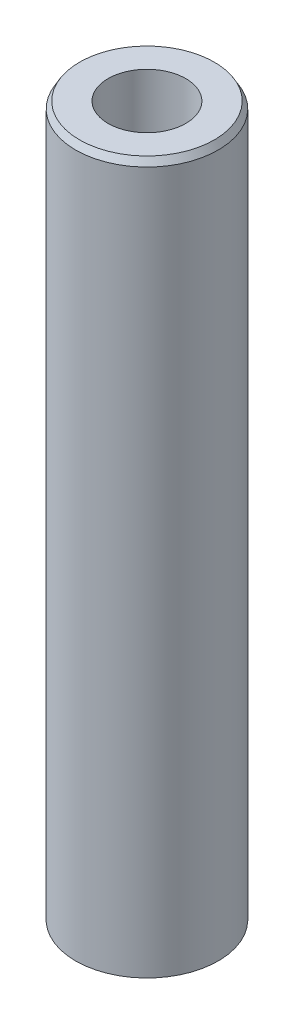
ISO-10303-21;
HEADER;
FILE_DESCRIPTION(('STEP AP214'),'2;1');
FILE_NAME('part.step','',(''),(''),'','','');
FILE_SCHEMA(('AUTOMOTIVE_DESIGN { 1 0 10303 214 1 1 1 1 }'));
ENDSEC;
DATA;
#1=APPLICATION_CONTEXT('core data for automotive mechanical design processes');
#2=APPLICATION_PROTOCOL_DEFINITION('international standard','automotive_design',2000,#1);
#3=PRODUCT_CONTEXT('',#1,'mechanical');
#4=PRODUCT('Part','Part','',(#3));
#5=PRODUCT_RELATED_PRODUCT_CATEGORY('part','',(#4));
#6=PRODUCT_DEFINITION_FORMATION('','',#4);
#7=PRODUCT_DEFINITION_CONTEXT('part definition',#1,'design');
#8=PRODUCT_DEFINITION('design','',#6,#7);
#9=PRODUCT_DEFINITION_SHAPE('','',#8);
#10=(LENGTH_UNIT() NAMED_UNIT(*) SI_UNIT(.MILLI.,.METRE.));
#11=(NAMED_UNIT(*) PLANE_ANGLE_UNIT() SI_UNIT($,.RADIAN.));
#12=(NAMED_UNIT(*) SI_UNIT($,.STERADIAN.) SOLID_ANGLE_UNIT());
#13=UNCERTAINTY_MEASURE_WITH_UNIT(LENGTH_MEASURE(1.E-05),#10,'distance_accuracy_value','');
#14=(GEOMETRIC_REPRESENTATION_CONTEXT(3) GLOBAL_UNCERTAINTY_ASSIGNED_CONTEXT((#13)) GLOBAL_UNIT_ASSIGNED_CONTEXT((#10,
#11,#12)) REPRESENTATION_CONTEXT('',''));
#15=CARTESIAN_POINT('',(0.,0.,0.));
#16=DIRECTION('',(0.,0.,1.));
#17=DIRECTION('',(1.,0.,0.));
#18=AXIS2_PLACEMENT_3D('',#15,#16,#17);
#19=CARTESIAN_POINT('',(0.,600.,0.));
#20=DIRECTION('',(0.,-1.,0.));
#21=DIRECTION('',(0.,0.,-1.));
#22=AXIS2_PLACEMENT_3D('',#19,#20,#21);
#23=CYLINDRICAL_SURFACE('',#22,60.);
#24=CARTESIAN_POINT('',(0.,594.272339193057,0.));
#25=DIRECTION('',(0.,1.,0.));
#26=DIRECTION('',(0.,0.,1.));
#27=AXIS2_PLACEMENT_3D('',#24,#25,#26);
#28=CIRCLE('',#27,60.);
#29=CARTESIAN_POINT('',(0.,594.272339193057,60.));
#30=VERTEX_POINT('',#29);
#31=EDGE_CURVE('E50',#30,#30,#28,.F.);
#32=ORIENTED_EDGE('',*,*,#31,.T.);
#33=EDGE_LOOP('',(#32));
#34=FACE_BOUND('',#33,.T.);
#35=CARTESIAN_POINT('',(0.,3.30686650871559,0.));
#36=DIRECTION('',(0.,1.,0.));
#37=DIRECTION('',(0.,0.,1.));
#38=AXIS2_PLACEMENT_3D('',#35,#36,#37);
#39=CIRCLE('',#38,60.);
#40=CARTESIAN_POINT('',(0.,3.30686650871559,60.));
#41=VERTEX_POINT('',#40);
#42=EDGE_CURVE('E51',#41,#41,#39,.T.);
#43=ORIENTED_EDGE('',*,*,#42,.T.);
#44=EDGE_LOOP('',(#43));
#45=FACE_BOUND('',#44,.T.);
#46=ADVANCED_FACE('F39',(#34,#45),#23,.T.);
#47=CARTESIAN_POINT('',(0.,600.,0.));
#48=DIRECTION('',(0.,1.,0.));
#49=DIRECTION('',(0.,0.,1.));
#50=AXIS2_PLACEMENT_3D('',#47,#48,#49);
#51=PLANE('',#50);
#52=CARTESIAN_POINT('',(0.,600.,0.));
#53=DIRECTION('',(0.,1.,0.));
#54=DIRECTION('',(0.,0.,1.));
#55=AXIS2_PLACEMENT_3D('',#52,#53,#54);
#56=CIRCLE('',#55,56.6931334912844);
#57=CARTESIAN_POINT('',(0.,600.,56.6931334912844));
#58=VERTEX_POINT('',#57);
#59=EDGE_CURVE('E54',#58,#58,#56,.T.);
#60=ORIENTED_EDGE('',*,*,#59,.T.);
#61=EDGE_LOOP('',(#60));
#62=FACE_BOUND('',#61,.T.);
#63=CARTESIAN_POINT('',(0.,600.,0.));
#64=DIRECTION('',(0.,1.,0.));
#65=DIRECTION('',(0.,0.,1.));
#66=AXIS2_PLACEMENT_3D('',#63,#64,#65);
#67=CIRCLE('',#66,32.7216538654029);
#68=CARTESIAN_POINT('',(0.,600.,32.7216538654029));
#69=VERTEX_POINT('',#68);
#70=EDGE_CURVE('E58',#69,#69,#67,.T.);
#71=ORIENTED_EDGE('',*,*,#70,.F.);
#72=EDGE_LOOP('',(#71));
#73=FACE_BOUND('',#72,.T.);
#74=ADVANCED_FACE('F69',(#62,#73),#51,.T.);
#75=CARTESIAN_POINT('',(0.,0.,0.));
#76=DIRECTION('',(0.,1.,0.));
#77=DIRECTION('',(0.,0.,1.));
#78=AXIS2_PLACEMENT_3D('',#75,#76,#77);
#79=PLANE('',#78);
#80=CARTESIAN_POINT('',(0.,0.,0.));
#81=DIRECTION('',(0.,1.,0.));
#82=DIRECTION('',(0.,0.,1.));
#83=AXIS2_PLACEMENT_3D('',#80,#81,#82);
#84=CIRCLE('',#83,54.2723391930566);
#85=CARTESIAN_POINT('',(0.,0.,54.2723391930566));
#86=VERTEX_POINT('',#85);
#87=EDGE_CURVE('E10',#86,#86,#84,.F.);
#88=ORIENTED_EDGE('',*,*,#87,.T.);
#89=EDGE_LOOP('',(#88));
#90=FACE_BOUND('',#89,.T.);
#91=CARTESIAN_POINT('',(0.,0.,0.));
#92=DIRECTION('',(0.,1.,0.));
#93=DIRECTION('',(0.,0.,1.));
#94=AXIS2_PLACEMENT_3D('',#91,#92,#93);
#95=CIRCLE('',#94,32.7216538654029);
#96=CARTESIAN_POINT('',(0.,0.,32.7216538654029));
#97=VERTEX_POINT('',#96);
#98=EDGE_CURVE('E63',#97,#97,#95,.T.);
#99=ORIENTED_EDGE('',*,*,#98,.T.);
#100=EDGE_LOOP('',(#99));
#101=FACE_BOUND('',#100,.T.);
#102=ADVANCED_FACE('F75',(#90,#101),#79,.F.);
#103=CARTESIAN_POINT('',(0.,600.,0.));
#104=DIRECTION('',(0.,-1.,0.));
#105=DIRECTION('',(0.,0.,-1.));
#106=AXIS2_PLACEMENT_3D('',#103,#104,#105);
#107=CYLINDRICAL_SURFACE('',#106,32.7216538654029);
#108=ORIENTED_EDGE('',*,*,#70,.T.);
#109=EDGE_LOOP('',(#108));
#110=FACE_BOUND('',#109,.T.);
#111=ORIENTED_EDGE('',*,*,#98,.F.);
#112=EDGE_LOOP('',(#111));
#113=FACE_BOUND('',#112,.T.);
#114=ADVANCED_FACE('F70',(#110,#113),#107,.F.);
#115=CARTESIAN_POINT('',(0.,600.,0.));
#116=DIRECTION('',(0.,-1.,0.));
#117=DIRECTION('',(0.,0.,-1.));
#118=AXIS2_PLACEMENT_3D('',#115,#116,#117);
#119=CONICAL_SURFACE('',#118,56.6931334912844,0.523598775598299);
#120=ORIENTED_EDGE('',*,*,#31,.F.);
#121=EDGE_LOOP('',(#120));
#122=FACE_BOUND('',#121,.T.);
#123=ORIENTED_EDGE('',*,*,#59,.F.);
#124=EDGE_LOOP('',(#123));
#125=FACE_BOUND('',#124,.T.);
#126=ADVANCED_FACE('F81',(#122,#125),#119,.T.);
#127=CARTESIAN_POINT('',(0.,3.30686650871559,0.));
#128=DIRECTION('',(0.,1.,0.));
#129=DIRECTION('',(0.,0.,1.));
#130=AXIS2_PLACEMENT_3D('',#127,#128,#129);
#131=CONICAL_SURFACE('',#130,60.,1.0471975511966);
#132=ORIENTED_EDGE('',*,*,#87,.F.);
#133=EDGE_LOOP('',(#132));
#134=FACE_BOUND('',#133,.T.);
#135=ORIENTED_EDGE('',*,*,#42,.F.);
#136=EDGE_LOOP('',(#135));
#137=FACE_BOUND('',#136,.T.);
#138=ADVANCED_FACE('F45',(#134,#137),#131,.T.);
#139=CLOSED_SHELL('',(#46,#74,#102,#114,#126,#138));
#140=MANIFOLD_SOLID_BREP('B2',#139);
#141=ADVANCED_BREP_SHAPE_REPRESENTATION('',(#18,#140),#14);
#142=SHAPE_DEFINITION_REPRESENTATION(#9,#141);
ENDSEC;
END-ISO-10303-21;
